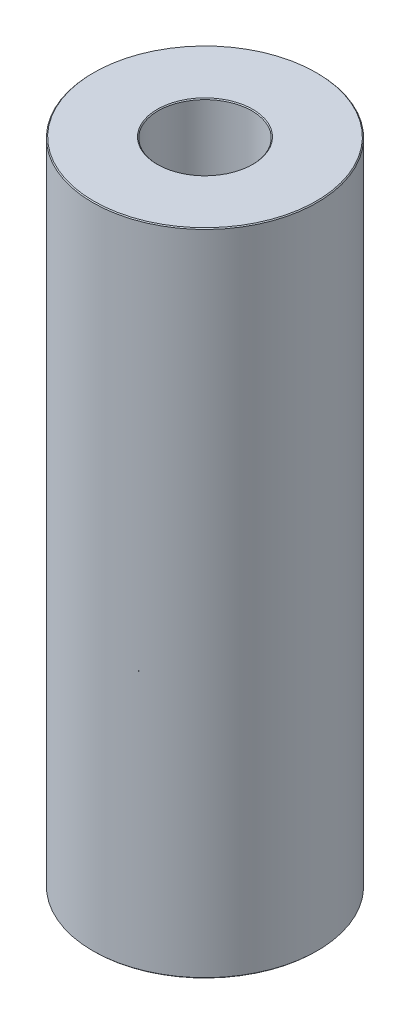
ISO-10303-21;
HEADER;
FILE_DESCRIPTION(('STEP AP214'),'2;1');
FILE_NAME('part.step','',(''),(''),'','','');
FILE_SCHEMA(('AUTOMOTIVE_DESIGN { 1 0 10303 214 1 1 1 1 }'));
ENDSEC;
DATA;
#1=APPLICATION_CONTEXT('core data for automotive mechanical design processes');
#2=APPLICATION_PROTOCOL_DEFINITION('international standard','automotive_design',2000,#1);
#3=PRODUCT_CONTEXT('',#1,'mechanical');
#4=PRODUCT('Part','Part','',(#3));
#5=PRODUCT_RELATED_PRODUCT_CATEGORY('part','',(#4));
#6=PRODUCT_DEFINITION_FORMATION('','',#4);
#7=PRODUCT_DEFINITION_CONTEXT('part definition',#1,'design');
#8=PRODUCT_DEFINITION('design','',#6,#7);
#9=PRODUCT_DEFINITION_SHAPE('','',#8);
#10=(LENGTH_UNIT() NAMED_UNIT(*) SI_UNIT(.MILLI.,.METRE.));
#11=(NAMED_UNIT(*) PLANE_ANGLE_UNIT() SI_UNIT($,.RADIAN.));
#12=(NAMED_UNIT(*) SI_UNIT($,.STERADIAN.) SOLID_ANGLE_UNIT());
#13=UNCERTAINTY_MEASURE_WITH_UNIT(LENGTH_MEASURE(1.E-05),#10,'distance_accuracy_value','');
#14=(GEOMETRIC_REPRESENTATION_CONTEXT(3) GLOBAL_UNCERTAINTY_ASSIGNED_CONTEXT((#13)) GLOBAL_UNIT_ASSIGNED_CONTEXT((#10,
#11,#12)) REPRESENTATION_CONTEXT('',''));
#15=CARTESIAN_POINT('',(0.,0.,0.));
#16=DIRECTION('',(0.,0.,1.));
#17=DIRECTION('',(1.,0.,0.));
#18=AXIS2_PLACEMENT_3D('',#15,#16,#17);
#19=CARTESIAN_POINT('',(0.,333.026938855026,0.));
#20=DIRECTION('',(0.,-1.,0.));
#21=DIRECTION('',(0.,0.,-1.));
#22=AXIS2_PLACEMENT_3D('',#19,#20,#21);
#23=CYLINDRICAL_SURFACE('',#22,57.5);
#24=CARTESIAN_POINT('',(0.,0.45424310133757,0.));
#25=DIRECTION('',(0.,1.,0.));
#26=DIRECTION('',(0.,0.,1.));
#27=AXIS2_PLACEMENT_3D('',#24,#25,#26);
#28=CIRCLE('',#27,57.5);
#29=CARTESIAN_POINT('',(0.,0.45424310133757,57.5));
#30=VERTEX_POINT('',#29);
#31=EDGE_CURVE('E10',#30,#30,#28,.T.);
#32=ORIENTED_EDGE('',*,*,#31,.T.);
#33=EDGE_LOOP('',(#32));
#34=FACE_BOUND('',#33,.T.);
#35=CARTESIAN_POINT('',(0.,332.572695753689,0.));
#36=DIRECTION('',(0.,1.,0.));
#37=DIRECTION('',(0.,0.,1.));
#38=AXIS2_PLACEMENT_3D('',#35,#36,#37);
#39=CIRCLE('',#38,57.5);
#40=CARTESIAN_POINT('',(0.,332.572695753689,57.5));
#41=VERTEX_POINT('',#40);
#42=EDGE_CURVE('E50',#41,#41,#39,.F.);
#43=ORIENTED_EDGE('',*,*,#42,.T.);
#44=EDGE_LOOP('',(#43));
#45=FACE_BOUND('',#44,.T.);
#46=ADVANCED_FACE('F39',(#34,#45),#23,.T.);
#47=CARTESIAN_POINT('',(0.,333.026938855026,0.));
#48=DIRECTION('',(0.,1.,0.));
#49=DIRECTION('',(0.,0.,1.));
#50=AXIS2_PLACEMENT_3D('',#47,#48,#49);
#51=PLANE('',#50);
#52=CARTESIAN_POINT('',(0.,333.026938855026,0.));
#53=DIRECTION('',(0.,1.,0.));
#54=DIRECTION('',(0.,0.,1.));
#55=AXIS2_PLACEMENT_3D('',#52,#53,#54);
#56=CIRCLE('',#55,24.4784298210055);
#57=CARTESIAN_POINT('',(0.,333.026938855026,24.4784298210055));
#58=VERTEX_POINT('',#57);
#59=EDGE_CURVE('E58',#58,#58,#56,.F.);
#60=ORIENTED_EDGE('',*,*,#59,.T.);
#61=EDGE_LOOP('',(#60));
#62=FACE_BOUND('',#61,.T.);
#63=CARTESIAN_POINT('',(0.,333.026938855026,0.));
#64=DIRECTION('',(0.,1.,0.));
#65=DIRECTION('',(0.,0.,1.));
#66=AXIS2_PLACEMENT_3D('',#63,#64,#65);
#67=CIRCLE('',#66,57.0457568986623);
#68=CARTESIAN_POINT('',(0.,333.026938855026,57.0457568986623));
#69=VERTEX_POINT('',#68);
#70=EDGE_CURVE('E61',#69,#69,#67,.T.);
#71=ORIENTED_EDGE('',*,*,#70,.T.);
#72=EDGE_LOOP('',(#71));
#73=FACE_BOUND('',#72,.T.);
#74=ADVANCED_FACE('F88',(#62,#73),#51,.T.);
#75=CARTESIAN_POINT('',(0.,0.,0.));
#76=DIRECTION('',(0.,1.,0.));
#77=DIRECTION('',(0.,0.,1.));
#78=AXIS2_PLACEMENT_3D('',#75,#76,#77);
#79=PLANE('',#78);
#80=CARTESIAN_POINT('',(0.,0.,0.));
#81=DIRECTION('',(0.,1.,0.));
#82=DIRECTION('',(0.,0.,1.));
#83=AXIS2_PLACEMENT_3D('',#80,#81,#82);
#84=CIRCLE('',#83,24.4784298210055);
#85=CARTESIAN_POINT('',(0.,0.,-24.4784298210055));
#86=VERTEX_POINT('',#85);
#87=EDGE_CURVE('E51',#86,#86,#84,.T.);
#88=ORIENTED_EDGE('',*,*,#87,.T.);
#89=EDGE_LOOP('',(#88));
#90=FACE_BOUND('',#89,.T.);
#91=CARTESIAN_POINT('',(0.,0.,0.));
#92=DIRECTION('',(0.,1.,0.));
#93=DIRECTION('',(0.,0.,1.));
#94=AXIS2_PLACEMENT_3D('',#91,#92,#93);
#95=CIRCLE('',#94,57.0457568986624);
#96=CARTESIAN_POINT('',(0.,0.,57.0457568986624));
#97=VERTEX_POINT('',#96);
#98=EDGE_CURVE('E54',#97,#97,#95,.F.);
#99=ORIENTED_EDGE('',*,*,#98,.T.);
#100=EDGE_LOOP('',(#99));
#101=FACE_BOUND('',#100,.T.);
#102=ADVANCED_FACE('F83',(#90,#101),#79,.F.);
#103=CARTESIAN_POINT('',(0.,333.026938855026,0.));
#104=DIRECTION('',(0.,-1.,0.));
#105=DIRECTION('',(0.,0.,-1.));
#106=AXIS2_PLACEMENT_3D('',#103,#104,#105);
#107=CYLINDRICAL_SURFACE('',#106,24.0241867196679);
#108=CARTESIAN_POINT('',(0.,332.572695753689,0.));
#109=DIRECTION('',(0.,1.,0.));
#110=DIRECTION('',(0.,0.,1.));
#111=AXIS2_PLACEMENT_3D('',#108,#109,#110);
#112=CIRCLE('',#111,24.0241867196679);
#113=CARTESIAN_POINT('',(0.,332.572695753689,24.0241867196679));
#114=VERTEX_POINT('',#113);
#115=EDGE_CURVE('E67',#114,#114,#112,.T.);
#116=ORIENTED_EDGE('',*,*,#115,.T.);
#117=EDGE_LOOP('',(#116));
#118=FACE_BOUND('',#117,.T.);
#119=CARTESIAN_POINT('',(0.,0.454243101337626,0.));
#120=DIRECTION('',(0.,1.,0.));
#121=DIRECTION('',(0.,0.,1.));
#122=AXIS2_PLACEMENT_3D('',#119,#120,#121);
#123=CIRCLE('',#122,24.0241867196679);
#124=CARTESIAN_POINT('',(0.,0.454243101337626,-24.0241867196679));
#125=VERTEX_POINT('',#124);
#126=EDGE_CURVE('E69',#125,#125,#123,.F.);
#127=ORIENTED_EDGE('',*,*,#126,.T.);
#128=EDGE_LOOP('',(#127));
#129=FACE_BOUND('',#128,.T.);
#130=ADVANCED_FACE('F71',(#118,#129),#107,.F.);
#131=CARTESIAN_POINT('',(0.,332.572695753689,0.));
#132=DIRECTION('',(0.,1.,0.));
#133=DIRECTION('',(0.,0.,1.));
#134=AXIS2_PLACEMENT_3D('',#131,#132,#133);
#135=CONICAL_SURFACE('',#134,24.0241867196679,0.785398163397471);
#136=ORIENTED_EDGE('',*,*,#59,.F.);
#137=EDGE_LOOP('',(#136));
#138=FACE_BOUND('',#137,.T.);
#139=ORIENTED_EDGE('',*,*,#115,.F.);
#140=EDGE_LOOP('',(#139));
#141=FACE_BOUND('',#140,.T.);
#142=ADVANCED_FACE('F77',(#138,#141),#135,.F.);
#143=CARTESIAN_POINT('',(0.,0.,0.));
#144=DIRECTION('',(0.,-1.,0.));
#145=DIRECTION('',(0.,0.,-1.));
#146=AXIS2_PLACEMENT_3D('',#143,#144,#145);
#147=CONICAL_SURFACE('',#146,24.4784298210055,0.785398163397441);
#148=CARTESIAN_POINT('',(0.,0.454243101337626,-24.0241867196679));
#149=CARTESIAN_POINT('',(0.,0.449511402365358,-24.0289184186402));
#150=CARTESIAN_POINT('',(0.,0.444779703393091,-24.0336501176125));
#151=CARTESIAN_POINT('',(0.,0.435316305448558,-24.043113515557));
#152=CARTESIAN_POINT('',(0.,0.430584606476291,-24.0478452145293));
#153=CARTESIAN_POINT('',(0.,0.421121208531757,-24.0573086124738));
#154=CARTESIAN_POINT('',(0.,0.41638950955949,-24.0620403114461));
#155=CARTESIAN_POINT('',(0.,0.406926111614956,-24.0715037093906));
#156=CARTESIAN_POINT('',(0.,0.40219441264269,-24.0762354083629));
#157=CARTESIAN_POINT('',(0.,0.392731014698156,-24.0856988063074));
#158=CARTESIAN_POINT('',(0.,0.387999315725888,-24.0904305052797));
#159=CARTESIAN_POINT('',(0.,0.378535917781354,-24.0998939032242));
#160=CARTESIAN_POINT('',(0.,0.373804218809088,-24.1046256021965));
#161=CARTESIAN_POINT('',(0.,0.364340820864554,-24.114089000141));
#162=CARTESIAN_POINT('',(0.,0.359609121892287,-24.1188206991133));
#163=CARTESIAN_POINT('',(0.,0.350145723947753,-24.1282840970578));
#164=CARTESIAN_POINT('',(0.,0.345414024975486,-24.1330157960301));
#165=CARTESIAN_POINT('',(0.,0.335950627030953,-24.1424791939746));
#166=CARTESIAN_POINT('',(0.,0.331218928058686,-24.1472108929469));
#167=CARTESIAN_POINT('',(0.,0.321755530114151,-24.1566742908914));
#168=CARTESIAN_POINT('',(0.,0.317023831141884,-24.1614059898637));
#169=CARTESIAN_POINT('',(0.,0.307560433197351,-24.1708693878082));
#170=CARTESIAN_POINT('',(0.,0.302828734225084,-24.1756010867805));
#171=CARTESIAN_POINT('',(0.,0.29336533628055,-24.185064484725));
#172=CARTESIAN_POINT('',(0.,0.288633637308283,-24.1897961836973));
#173=CARTESIAN_POINT('',(0.,0.279170239363749,-24.1992595816418));
#174=CARTESIAN_POINT('',(0.,0.274438540391482,-24.2039912806141));
#175=CARTESIAN_POINT('',(0.,0.264975142446949,-24.2134546785586));
#176=CARTESIAN_POINT('',(0.,0.260243443474681,-24.2181863775309));
#177=CARTESIAN_POINT('',(0.,0.250780045530147,-24.2276497754754));
#178=CARTESIAN_POINT('',(0.,0.246048346557881,-24.2323814744477));
#179=CARTESIAN_POINT('',(0.,0.236584948613347,-24.2418448723922));
#180=CARTESIAN_POINT('',(0.,0.23185324964108,-24.2465765713645));
#181=CARTESIAN_POINT('',(0.,0.222389851696546,-24.256039969309));
#182=CARTESIAN_POINT('',(0.,0.217658152724279,-24.2607716682813));
#183=CARTESIAN_POINT('',(0.,0.208194754779745,-24.2702350662258));
#184=CARTESIAN_POINT('',(0.,0.203463055807479,-24.2749667651981));
#185=CARTESIAN_POINT('',(0.,0.193999657862945,-24.2844301631426));
#186=CARTESIAN_POINT('',(0.,0.189267958890677,-24.2891618621149));
#187=CARTESIAN_POINT('',(0.,0.179804560946143,-24.2986252600594));
#188=CARTESIAN_POINT('',(0.,0.175072861973877,-24.3033569590317));
#189=CARTESIAN_POINT('',(0.,0.165609464029343,-24.3128203569762));
#190=CARTESIAN_POINT('',(0.,0.160877765057075,-24.3175520559485));
#191=CARTESIAN_POINT('',(0.,0.151414367112542,-24.327015453893));
#192=CARTESIAN_POINT('',(0.,0.146682668140275,-24.3317471528653));
#193=CARTESIAN_POINT('',(0.,0.137219270195741,-24.3412105508098));
#194=CARTESIAN_POINT('',(0.,0.132487571223474,-24.3459422497821));
#195=CARTESIAN_POINT('',(0.,0.12302417327894,-24.3554056477266));
#196=CARTESIAN_POINT('',(0.,0.118292474306674,-24.3601373466989));
#197=CARTESIAN_POINT('',(0.,0.10882907636214,-24.3696007446434));
#198=CARTESIAN_POINT('',(0.,0.104097377389873,-24.3743324436157));
#199=CARTESIAN_POINT('',(0.,0.0946339794453385,-24.3837958415602));
#200=CARTESIAN_POINT('',(0.,0.0899022804730713,-24.3885275405325));
#201=CARTESIAN_POINT('',(0.,0.0804388825285377,-24.397990938477));
#202=CARTESIAN_POINT('',(0.,0.0757071835562713,-24.4027226374493));
#203=CARTESIAN_POINT('',(0.,0.0662437856117373,-24.4121860353938));
#204=CARTESIAN_POINT('',(0.,0.0615120866394699,-24.4169177343661));
#205=CARTESIAN_POINT('',(0.,0.052048688694936,-24.4263811323106));
#206=CARTESIAN_POINT('',(0.,0.0473169897226696,-24.4311128312829));
#207=CARTESIAN_POINT('',(0.,0.0378535917781358,-24.4405762292274));
#208=CARTESIAN_POINT('',(0.,0.0331218928058683,-24.4453079281997));
#209=CARTESIAN_POINT('',(0.,0.0236584948613343,-24.4547713261442));
#210=CARTESIAN_POINT('',(0.,0.0189267958890677,-24.4595030251165));
#211=CARTESIAN_POINT('',(0.,0.0094633979445345,-24.468966423061));
#212=CARTESIAN_POINT('',(0.,0.0047316989722679,-24.4736981220333));
#213=CARTESIAN_POINT('',(0.,0.,-24.4784298210055));
#214=B_SPLINE_CURVE_WITH_KNOTS('',3,(#148,#149,#150,#151,#152,#153,#154,#155,#156,#157,#158,
#159,#160,#161,#162,#163,#164,#165,#166,#167,#168,#169,#170,#171,#172,#173,#174,#175,#176,#177,
#178,#179,#180,#181,#182,#183,#184,#185,#186,#187,#188,#189,#190,#191,#192,#193,#194,#195,#196,
#197,#198,#199,#200,#201,#202,#203,#204,#205,#206,#207,#208,#209,#210,#211,#212,#213),
.UNSPECIFIED.,.F.,.F.,(4,2,2,2,2,2,2,2,2,2,2,2,2,2,2,2,2,2,2,2,2,2,2,2,2,2,2,2,2,2,2,2,4),(0.,
0.020074898578939,0.0401497971578804,0.0602246957368194,0.0802995943157608,0.1003744928947,
0.120449391473641,0.14052429005258,0.160599188631522,0.180674087210461,0.2007489857894,
0.220823884368341,0.24089878294728,0.260973681526221,0.28104858010516,0.301123478684102,
0.321198377263041,0.34127327584198,0.361348174420921,0.38142307299986,0.401497971578802,
0.421572870157741,0.441647768736682,0.461722667315621,0.481797565894563,0.501872464473501,
0.52194736305244,0.542022261631382,0.562097160210321,0.582172058789262,0.602246957368201,
0.622321855947143,0.642396754526081),.UNSPECIFIED.);
#215=EDGE_CURVE('BSEAM73',#125,#86,#214,.T.);
#216=ORIENTED_EDGE('',*,*,#126,.F.);
#217=ORIENTED_EDGE('',*,*,#87,.F.);
#218=ORIENTED_EDGE('',*,*,#215,.T.);
#219=ORIENTED_EDGE('',*,*,#215,.F.);
#220=EDGE_LOOP('',(#216,#218,#217,#219));
#221=FACE_BOUND('',#220,.T.);
#222=ADVANCED_FACE('F73',(#221),#147,.F.);
#223=CARTESIAN_POINT('',(0.,0.45424310133757,0.));
#224=DIRECTION('',(0.,1.,0.));
#225=DIRECTION('',(0.,0.,1.));
#226=AXIS2_PLACEMENT_3D('',#223,#224,#225);
#227=CONICAL_SURFACE('',#226,57.5,0.785398163397448);
#228=ORIENTED_EDGE('',*,*,#98,.F.);
#229=EDGE_LOOP('',(#228));
#230=FACE_BOUND('',#229,.T.);
#231=ORIENTED_EDGE('',*,*,#31,.F.);
#232=EDGE_LOOP('',(#231));
#233=FACE_BOUND('',#232,.T.);
#234=ADVANCED_FACE('F76',(#230,#233),#227,.T.);
#235=CARTESIAN_POINT('',(0.,333.026938855026,0.));
#236=DIRECTION('',(0.,-1.,0.));
#237=DIRECTION('',(0.,0.,-1.));
#238=AXIS2_PLACEMENT_3D('',#235,#236,#237);
#239=CONICAL_SURFACE('',#238,57.0457568986623,0.785398163397463);
#240=ORIENTED_EDGE('',*,*,#42,.F.);
#241=EDGE_LOOP('',(#240));
#242=FACE_BOUND('',#241,.T.);
#243=ORIENTED_EDGE('',*,*,#70,.F.);
#244=EDGE_LOOP('',(#243));
#245=FACE_BOUND('',#244,.T.);
#246=ADVANCED_FACE('F45',(#242,#245),#239,.T.);
#247=CLOSED_SHELL('',(#46,#74,#102,#130,#142,#222,#234,#246));
#248=MANIFOLD_SOLID_BREP('B2',#247);
#249=ADVANCED_BREP_SHAPE_REPRESENTATION('',(#18,#248),#14);
#250=SHAPE_DEFINITION_REPRESENTATION(#9,#249);
ENDSEC;
END-ISO-10303-21;
